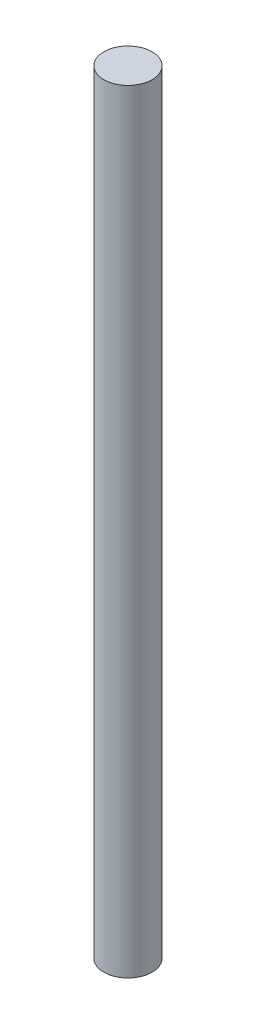
ISO-10303-21;
HEADER;
FILE_DESCRIPTION(('STEP AP214'),'2;1');
FILE_NAME('part.step','',(''),(''),'','','');
FILE_SCHEMA(('AUTOMOTIVE_DESIGN { 1 0 10303 214 1 1 1 1 }'));
ENDSEC;
DATA;
#1=APPLICATION_CONTEXT('core data for automotive mechanical design processes');
#2=APPLICATION_PROTOCOL_DEFINITION('international standard','automotive_design',2000,#1);
#3=PRODUCT_CONTEXT('',#1,'mechanical');
#4=PRODUCT('Part','Part','',(#3));
#5=PRODUCT_RELATED_PRODUCT_CATEGORY('part','',(#4));
#6=PRODUCT_DEFINITION_FORMATION('','',#4);
#7=PRODUCT_DEFINITION_CONTEXT('part definition',#1,'design');
#8=PRODUCT_DEFINITION('design','',#6,#7);
#9=PRODUCT_DEFINITION_SHAPE('','',#8);
#10=(LENGTH_UNIT() NAMED_UNIT(*) SI_UNIT(.MILLI.,.METRE.));
#11=(NAMED_UNIT(*) PLANE_ANGLE_UNIT() SI_UNIT($,.RADIAN.));
#12=(NAMED_UNIT(*) SI_UNIT($,.STERADIAN.) SOLID_ANGLE_UNIT());
#13=UNCERTAINTY_MEASURE_WITH_UNIT(LENGTH_MEASURE(1.E-05),#10,'distance_accuracy_value','');
#14=(GEOMETRIC_REPRESENTATION_CONTEXT(3) GLOBAL_UNCERTAINTY_ASSIGNED_CONTEXT((#13)) GLOBAL_UNIT_ASSIGNED_CONTEXT((#10,
#11,#12)) REPRESENTATION_CONTEXT('',''));
#15=CARTESIAN_POINT('',(0.,0.,0.));
#16=DIRECTION('',(0.,0.,1.));
#17=DIRECTION('',(1.,0.,0.));
#18=AXIS2_PLACEMENT_3D('',#15,#16,#17);
#19=CARTESIAN_POINT('',(0.,152.4,0.));
#20=DIRECTION('',(0.,-1.,0.));
#21=DIRECTION('',(0.,0.,-1.));
#22=AXIS2_PLACEMENT_3D('',#19,#20,#21);
#23=CYLINDRICAL_SURFACE('',#22,4.7625);
#24=CARTESIAN_POINT('',(0.,152.4,0.));
#25=DIRECTION('',(0.,1.,0.));
#26=DIRECTION('',(0.,0.,1.));
#27=AXIS2_PLACEMENT_3D('',#24,#25,#26);
#28=CIRCLE('',#27,4.7625);
#29=CARTESIAN_POINT('',(0.,152.4,4.7625));
#30=VERTEX_POINT('',#29);
#31=EDGE_CURVE('E10',#30,#30,#28,.T.);
#32=ORIENTED_EDGE('',*,*,#31,.F.);
#33=EDGE_LOOP('',(#32));
#34=FACE_BOUND('',#33,.T.);
#35=CARTESIAN_POINT('',(0.,0.,0.));
#36=DIRECTION('',(0.,1.,0.));
#37=DIRECTION('',(0.,0.,1.));
#38=AXIS2_PLACEMENT_3D('',#35,#36,#37);
#39=CIRCLE('',#38,4.7625);
#40=CARTESIAN_POINT('',(0.,0.,4.7625));
#41=VERTEX_POINT('',#40);
#42=EDGE_CURVE('E34',#41,#41,#39,.T.);
#43=ORIENTED_EDGE('',*,*,#42,.T.);
#44=EDGE_LOOP('',(#43));
#45=FACE_BOUND('',#44,.T.);
#46=ADVANCED_FACE('F31',(#34,#45),#23,.T.);
#47=CARTESIAN_POINT('',(0.,152.4,0.));
#48=DIRECTION('',(0.,1.,0.));
#49=DIRECTION('',(0.,0.,1.));
#50=AXIS2_PLACEMENT_3D('',#47,#48,#49);
#51=PLANE('',#50);
#52=ORIENTED_EDGE('',*,*,#31,.T.);
#53=EDGE_LOOP('',(#52));
#54=FACE_BOUND('',#53,.T.);
#55=ADVANCED_FACE('F46',(#54),#51,.T.);
#56=CARTESIAN_POINT('',(0.,0.,0.));
#57=DIRECTION('',(0.,1.,0.));
#58=DIRECTION('',(0.,0.,1.));
#59=AXIS2_PLACEMENT_3D('',#56,#57,#58);
#60=PLANE('',#59);
#61=ORIENTED_EDGE('',*,*,#42,.F.);
#62=EDGE_LOOP('',(#61));
#63=FACE_BOUND('',#62,.T.);
#64=ADVANCED_FACE('F44',(#63),#60,.F.);
#65=CLOSED_SHELL('',(#46,#55,#64));
#66=MANIFOLD_SOLID_BREP('B2',#65);
#67=ADVANCED_BREP_SHAPE_REPRESENTATION('',(#18,#66),#14);
#68=SHAPE_DEFINITION_REPRESENTATION(#9,#67);
ENDSEC;
END-ISO-10303-21;
